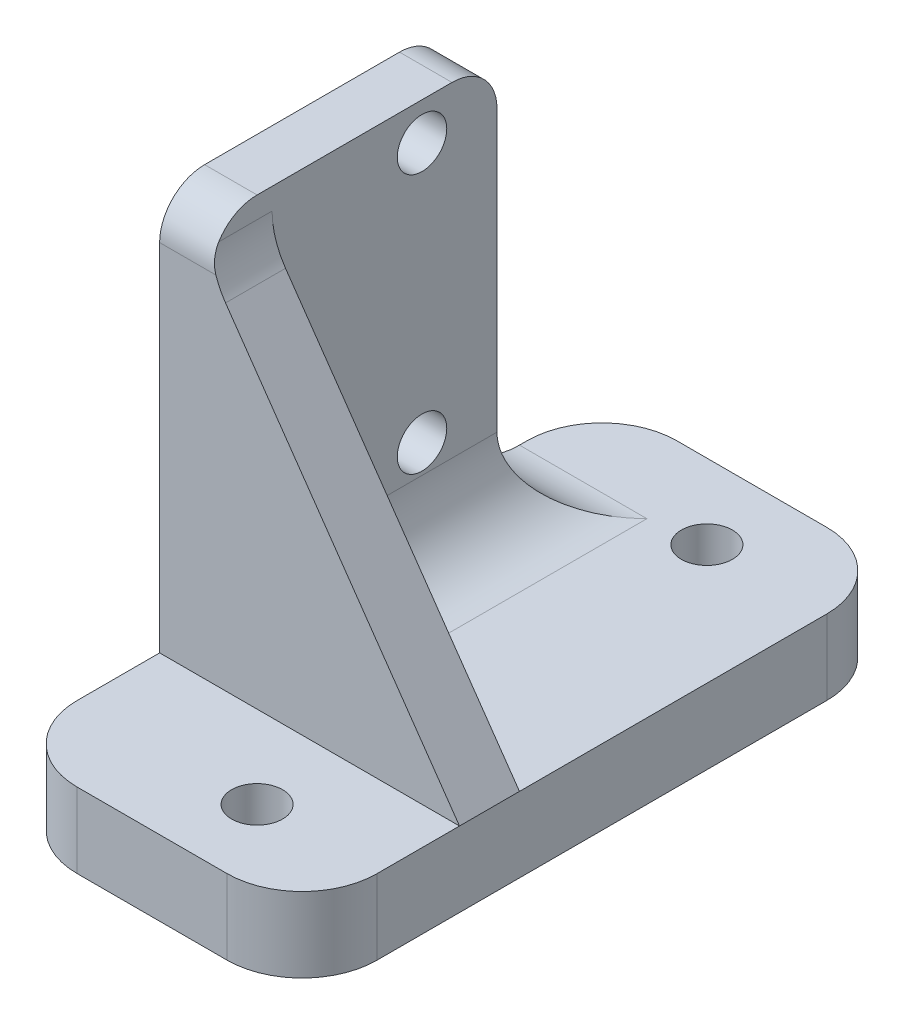
ISO-10303-21;
HEADER;
FILE_DESCRIPTION(('STEP AP214'),'2;1');
FILE_NAME('part.step','',(''),(''),'','','');
FILE_SCHEMA(('AUTOMOTIVE_DESIGN { 1 0 10303 214 1 1 1 1 }'));
ENDSEC;
DATA;
#1=APPLICATION_CONTEXT('core data for automotive mechanical design processes');
#2=APPLICATION_PROTOCOL_DEFINITION('international standard','automotive_design',2000,#1);
#3=PRODUCT_CONTEXT('',#1,'mechanical');
#4=PRODUCT('Part','Part','',(#3));
#5=PRODUCT_RELATED_PRODUCT_CATEGORY('part','',(#4));
#6=PRODUCT_DEFINITION_FORMATION('','',#4);
#7=PRODUCT_DEFINITION_CONTEXT('part definition',#1,'design');
#8=PRODUCT_DEFINITION('design','',#6,#7);
#9=PRODUCT_DEFINITION_SHAPE('','',#8);
#10=(LENGTH_UNIT() NAMED_UNIT(*) SI_UNIT(.MILLI.,.METRE.));
#11=(NAMED_UNIT(*) PLANE_ANGLE_UNIT() SI_UNIT($,.RADIAN.));
#12=(NAMED_UNIT(*) SI_UNIT($,.STERADIAN.) SOLID_ANGLE_UNIT());
#13=UNCERTAINTY_MEASURE_WITH_UNIT(LENGTH_MEASURE(1.E-05),#10,'distance_accuracy_value','');
#14=(GEOMETRIC_REPRESENTATION_CONTEXT(3) GLOBAL_UNCERTAINTY_ASSIGNED_CONTEXT((#13)) GLOBAL_UNIT_ASSIGNED_CONTEXT((#10,
#11,#12)) REPRESENTATION_CONTEXT('',''));
#15=CARTESIAN_POINT('',(0.,0.,0.));
#16=DIRECTION('',(0.,0.,1.));
#17=DIRECTION('',(1.,0.,0.));
#18=AXIS2_PLACEMENT_3D('',#15,#16,#17);
#19=CARTESIAN_POINT('',(0.,5.,0.));
#20=DIRECTION('',(0.,-1.,0.));
#21=DIRECTION('',(0.,0.,-1.));
#22=AXIS2_PLACEMENT_3D('',#19,#20,#21);
#23=PLANE('',#22);
#24=CARTESIAN_POINT('',(12.,5.,-35.));
#25=DIRECTION('',(0.,1.,0.));
#26=DIRECTION('',(0.,0.,1.));
#27=AXIS2_PLACEMENT_3D('',#24,#25,#26);
#28=CIRCLE('',#27,1.7);
#29=CARTESIAN_POINT('',(12.,5.,-33.3));
#30=VERTEX_POINT('',#29);
#31=EDGE_CURVE('E418',#30,#30,#28,.T.);
#32=ORIENTED_EDGE('',*,*,#31,.F.);
#33=EDGE_LOOP('',(#32));
#34=FACE_BOUND('',#33,.T.);
#35=DIRECTION('',(-1.,0.,0.));
#36=VECTOR('',#35,1.);
#37=CARTESIAN_POINT('',(0.,5.,-34.5));
#38=LINE('',#37,#36);
#39=CARTESIAN_POINT('',(0.,5.,-34.5));
#40=VERTEX_POINT('',#39);
#41=CARTESIAN_POINT('',(8.5,5.,-34.5));
#42=VERTEX_POINT('',#41);
#43=EDGE_CURVE('E287',#40,#42,#38,.F.);
#44=ORIENTED_EDGE('',*,*,#43,.T.);
#45=DIRECTION('',(0.,0.,1.));
#46=VECTOR('',#45,1.);
#47=CARTESIAN_POINT('',(8.5,5.,0.));
#48=LINE('',#47,#46);
#49=CARTESIAN_POINT('',(8.5,5.,-14.5));
#50=VERTEX_POINT('',#49);
#51=EDGE_CURVE('E289',#42,#50,#48,.T.);
#52=ORIENTED_EDGE('',*,*,#51,.T.);
#53=DIRECTION('',(-1.,0.,0.));
#54=VECTOR('',#53,1.);
#55=CARTESIAN_POINT('',(0.,5.,-14.5));
#56=LINE('',#55,#54);
#57=CARTESIAN_POINT('',(20.,5.,-14.5));
#58=VERTEX_POINT('',#57);
#59=EDGE_CURVE('E199',#58,#50,#56,.T.);
#60=ORIENTED_EDGE('',*,*,#59,.F.);
#61=DIRECTION('',(0.,0.,-1.));
#62=VECTOR('',#61,1.);
#63=CARTESIAN_POINT('',(20.,5.,0.));
#64=LINE('',#63,#62);
#65=CARTESIAN_POINT('',(20.,5.,-35.));
#66=VERTEX_POINT('',#65);
#67=EDGE_CURVE('E198',#58,#66,#64,.T.);
#68=ORIENTED_EDGE('',*,*,#67,.T.);
#69=CARTESIAN_POINT('',(15.,5.,-35.));
#70=DIRECTION('',(0.,-1.,0.));
#71=DIRECTION('',(0.,0.,-1.));
#72=AXIS2_PLACEMENT_3D('',#69,#70,#71);
#73=CIRCLE('',#72,5.);
#74=CARTESIAN_POINT('',(15.,5.,-40.));
#75=VERTEX_POINT('',#74);
#76=EDGE_CURVE('E254',#66,#75,#73,.F.);
#77=ORIENTED_EDGE('',*,*,#76,.T.);
#78=DIRECTION('',(-1.,0.,0.));
#79=VECTOR('',#78,1.);
#80=CARTESIAN_POINT('',(0.,5.,-40.));
#81=LINE('',#80,#79);
#82=CARTESIAN_POINT('',(5.,5.,-40.));
#83=VERTEX_POINT('',#82);
#84=EDGE_CURVE('E205',#75,#83,#81,.T.);
#85=ORIENTED_EDGE('',*,*,#84,.T.);
#86=CARTESIAN_POINT('',(5.,5.,-35.));
#87=DIRECTION('',(0.,-1.,0.));
#88=DIRECTION('',(0.,0.,-1.));
#89=AXIS2_PLACEMENT_3D('',#86,#87,#88);
#90=CIRCLE('',#89,5.);
#91=CARTESIAN_POINT('',(0.,5.,-35.));
#92=VERTEX_POINT('',#91);
#93=EDGE_CURVE('E252',#83,#92,#90,.F.);
#94=ORIENTED_EDGE('',*,*,#93,.T.);
#95=DIRECTION('',(0.,0.,1.));
#96=VECTOR('',#95,1.);
#97=CARTESIAN_POINT('',(0.,5.,0.));
#98=LINE('',#97,#96);
#99=EDGE_CURVE('E393',#92,#40,#98,.T.);
#100=ORIENTED_EDGE('',*,*,#99,.T.);
#101=EDGE_LOOP('',(#44,#52,#60,#68,#77,#85,#94,#100));
#102=FACE_BOUND('',#101,.T.);
#103=ADVANCED_FACE('F34',(#34,#102),#23,.F.);
#104=CARTESIAN_POINT('',(12.,5.,-4.99999999999999));
#105=DIRECTION('',(0.,1.,0.));
#106=DIRECTION('',(0.,0.,-1.));
#107=AXIS2_PLACEMENT_3D('',#104,#105,#106);
#108=CIRCLE('',#107,1.7);
#109=CARTESIAN_POINT('',(12.,5.,-6.69999999999999));
#110=VERTEX_POINT('',#109);
#111=EDGE_CURVE('E412',#110,#110,#108,.T.);
#112=ORIENTED_EDGE('',*,*,#111,.F.);
#113=EDGE_LOOP('',(#112));
#114=FACE_BOUND('',#113,.T.);
#115=CARTESIAN_POINT('',(20.,5.,-5.));
#116=VERTEX_POINT('',#115);
#117=CARTESIAN_POINT('',(20.,5.,-10.5));
#118=VERTEX_POINT('',#117);
#119=EDGE_CURVE('E195',#116,#118,#64,.T.);
#120=ORIENTED_EDGE('',*,*,#119,.T.);
#121=DIRECTION('',(-1.,0.,0.));
#122=VECTOR('',#121,1.);
#123=CARTESIAN_POINT('',(3.5,5.,-10.5));
#124=LINE('',#123,#122);
#125=CARTESIAN_POINT('',(0.,5.,-10.5));
#126=VERTEX_POINT('',#125);
#127=EDGE_CURVE('E179',#118,#126,#124,.T.);
#128=ORIENTED_EDGE('',*,*,#127,.T.);
#129=CARTESIAN_POINT('',(0.,5.,-5.));
#130=VERTEX_POINT('',#129);
#131=EDGE_CURVE('E223',#126,#130,#98,.T.);
#132=ORIENTED_EDGE('',*,*,#131,.T.);
#133=CARTESIAN_POINT('',(5.,5.,-5.));
#134=DIRECTION('',(0.,-1.,0.));
#135=DIRECTION('',(0.,0.,-1.));
#136=AXIS2_PLACEMENT_3D('',#133,#134,#135);
#137=CIRCLE('',#136,5.);
#138=CARTESIAN_POINT('',(5.,5.,0.));
#139=VERTEX_POINT('',#138);
#140=EDGE_CURVE('E256',#130,#139,#137,.F.);
#141=ORIENTED_EDGE('',*,*,#140,.T.);
#142=DIRECTION('',(1.,0.,0.));
#143=VECTOR('',#142,1.);
#144=CARTESIAN_POINT('',(0.,5.,0.));
#145=LINE('',#144,#143);
#146=CARTESIAN_POINT('',(15.,5.,0.));
#147=VERTEX_POINT('',#146);
#148=EDGE_CURVE('E210',#139,#147,#145,.T.);
#149=ORIENTED_EDGE('',*,*,#148,.T.);
#150=CARTESIAN_POINT('',(15.,5.,-5.));
#151=DIRECTION('',(0.,-1.,0.));
#152=DIRECTION('',(0.,0.,-1.));
#153=AXIS2_PLACEMENT_3D('',#150,#151,#152);
#154=CIRCLE('',#153,5.);
#155=EDGE_CURVE('E204',#147,#116,#154,.F.);
#156=ORIENTED_EDGE('',*,*,#155,.T.);
#157=EDGE_LOOP('',(#120,#128,#132,#141,#149,#156));
#158=FACE_BOUND('',#157,.T.);
#159=ADVANCED_FACE('F201',(#114,#158),#23,.F.);
#160=CARTESIAN_POINT('',(0.,5.,0.));
#161=DIRECTION('',(1.,0.,0.));
#162=DIRECTION('',(0.,0.,-1.));
#163=AXIS2_PLACEMENT_3D('',#160,#161,#162);
#164=PLANE('',#163);
#165=ORIENTED_EDGE('',*,*,#131,.F.);
#166=DIRECTION('',(0.,1.,0.));
#167=VECTOR('',#166,1.);
#168=CARTESIAN_POINT('',(0.,5.,-10.5));
#169=LINE('',#168,#167);
#170=CARTESIAN_POINT('',(0.,28.7,-10.5));
#171=VERTEX_POINT('',#170);
#172=EDGE_CURVE('E182',#126,#171,#169,.T.);
#173=ORIENTED_EDGE('',*,*,#172,.T.);
#174=CARTESIAN_POINT('',(0.,28.7,-13.5));
#175=DIRECTION('',(1.,0.,0.));
#176=DIRECTION('',(0.,0.,-1.));
#177=AXIS2_PLACEMENT_3D('',#174,#175,#176);
#178=CIRCLE('',#177,3.);
#179=CARTESIAN_POINT('',(0.,31.7,-13.5));
#180=VERTEX_POINT('',#179);
#181=EDGE_CURVE('E272',#171,#180,#178,.F.);
#182=ORIENTED_EDGE('',*,*,#181,.T.);
#183=DIRECTION('',(0.,0.,-1.));
#184=VECTOR('',#183,1.);
#185=CARTESIAN_POINT('',(0.,31.7,-29.5));
#186=LINE('',#185,#184);
#187=CARTESIAN_POINT('',(0.,31.7,-26.5));
#188=VERTEX_POINT('',#187);
#189=EDGE_CURVE('E398',#180,#188,#186,.T.);
#190=ORIENTED_EDGE('',*,*,#189,.T.);
#191=CARTESIAN_POINT('',(0.,28.7,-26.5));
#192=DIRECTION('',(1.,0.,0.));
#193=DIRECTION('',(0.,0.,-1.));
#194=AXIS2_PLACEMENT_3D('',#191,#192,#193);
#195=CIRCLE('',#194,3.);
#196=CARTESIAN_POINT('',(0.,28.7,-29.5));
#197=VERTEX_POINT('',#196);
#198=EDGE_CURVE('E274',#188,#197,#195,.F.);
#199=ORIENTED_EDGE('',*,*,#198,.T.);
#200=DIRECTION('',(0.,-1.,0.));
#201=VECTOR('',#200,1.);
#202=CARTESIAN_POINT('',(0.,5.,-29.5));
#203=LINE('',#202,#201);
#204=CARTESIAN_POINT('',(0.,10.,-29.5));
#205=VERTEX_POINT('',#204);
#206=EDGE_CURVE('E231',#197,#205,#203,.T.);
#207=ORIENTED_EDGE('',*,*,#206,.T.);
#208=CARTESIAN_POINT('',(0.,10.,-34.5));
#209=DIRECTION('',(1.,0.,0.));
#210=DIRECTION('',(0.,0.,-1.));
#211=AXIS2_PLACEMENT_3D('',#208,#209,#210);
#212=CIRCLE('',#211,5.);
#213=EDGE_CURVE('E11',#205,#40,#212,.T.);
#214=ORIENTED_EDGE('',*,*,#213,.T.);
#215=ORIENTED_EDGE('',*,*,#99,.F.);
#216=DIRECTION('',(0.,-1.,0.));
#217=VECTOR('',#216,1.);
#218=CARTESIAN_POINT('',(0.,5.,-35.));
#219=LINE('',#218,#217);
#220=CARTESIAN_POINT('',(0.,0.,-35.));
#221=VERTEX_POINT('',#220);
#222=EDGE_CURVE('E246',#92,#221,#219,.T.);
#223=ORIENTED_EDGE('',*,*,#222,.T.);
#224=DIRECTION('',(0.,0.,1.));
#225=VECTOR('',#224,1.);
#226=CARTESIAN_POINT('',(0.,0.,0.));
#227=LINE('',#226,#225);
#228=CARTESIAN_POINT('',(0.,0.,-5.));
#229=VERTEX_POINT('',#228);
#230=EDGE_CURVE('E187',#221,#229,#227,.T.);
#231=ORIENTED_EDGE('',*,*,#230,.T.);
#232=DIRECTION('',(0.,-1.,0.));
#233=VECTOR('',#232,1.);
#234=CARTESIAN_POINT('',(0.,5.,-5.));
#235=LINE('',#234,#233);
#236=EDGE_CURVE('E249',#229,#130,#235,.F.);
#237=ORIENTED_EDGE('',*,*,#236,.T.);
#238=EDGE_LOOP('',(#165,#173,#182,#190,#199,#207,#214,#215,#223,#231,#237));
#239=FACE_BOUND('',#238,.T.);
#240=CARTESIAN_POINT('',(0.,11.9,-24.5));
#241=DIRECTION('',(-1.,0.,0.));
#242=DIRECTION('',(0.,0.,-1.));
#243=AXIS2_PLACEMENT_3D('',#240,#241,#242);
#244=CIRCLE('',#243,1.65);
#245=CARTESIAN_POINT('',(0.,11.9,-26.15));
#246=VERTEX_POINT('',#245);
#247=EDGE_CURVE('E406',#246,#246,#244,.T.);
#248=ORIENTED_EDGE('',*,*,#247,.F.);
#249=EDGE_LOOP('',(#248));
#250=FACE_BOUND('',#249,.T.);
#251=CARTESIAN_POINT('',(0.,29.2,-24.5));
#252=DIRECTION('',(-1.,0.,0.));
#253=DIRECTION('',(0.,0.,1.));
#254=AXIS2_PLACEMENT_3D('',#251,#252,#253);
#255=CIRCLE('',#254,1.65);
#256=CARTESIAN_POINT('',(0.,29.2,-22.85));
#257=VERTEX_POINT('',#256);
#258=EDGE_CURVE('E228',#257,#257,#255,.T.);
#259=ORIENTED_EDGE('',*,*,#258,.F.);
#260=EDGE_LOOP('',(#259));
#261=FACE_BOUND('',#260,.T.);
#262=ADVANCED_FACE('F335',(#239,#250,#261),#164,.F.);
#263=CARTESIAN_POINT('',(0.,5.,0.));
#264=DIRECTION('',(0.,0.,-1.));
#265=DIRECTION('',(-1.,0.,0.));
#266=AXIS2_PLACEMENT_3D('',#263,#264,#265);
#267=PLANE('',#266);
#268=ORIENTED_EDGE('',*,*,#148,.F.);
#269=DIRECTION('',(0.,-1.,0.));
#270=VECTOR('',#269,1.);
#271=CARTESIAN_POINT('',(5.,5.,0.));
#272=LINE('',#271,#270);
#273=CARTESIAN_POINT('',(5.,0.,0.));
#274=VERTEX_POINT('',#273);
#275=EDGE_CURVE('E233',#139,#274,#272,.T.);
#276=ORIENTED_EDGE('',*,*,#275,.T.);
#277=DIRECTION('',(1.,0.,0.));
#278=VECTOR('',#277,1.);
#279=CARTESIAN_POINT('',(0.,0.,0.));
#280=LINE('',#279,#278);
#281=CARTESIAN_POINT('',(15.,0.,0.));
#282=VERTEX_POINT('',#281);
#283=EDGE_CURVE('E215',#274,#282,#280,.T.);
#284=ORIENTED_EDGE('',*,*,#283,.T.);
#285=DIRECTION('',(0.,-1.,0.));
#286=VECTOR('',#285,1.);
#287=CARTESIAN_POINT('',(15.,5.,0.));
#288=LINE('',#287,#286);
#289=EDGE_CURVE('E208',#282,#147,#288,.F.);
#290=ORIENTED_EDGE('',*,*,#289,.T.);
#291=EDGE_LOOP('',(#268,#276,#284,#290));
#292=FACE_BOUND('',#291,.T.);
#293=ADVANCED_FACE('F353',(#292),#267,.F.);
#294=CARTESIAN_POINT('',(20.,5.,0.));
#295=DIRECTION('',(-1.,0.,0.));
#296=DIRECTION('',(0.,0.,1.));
#297=AXIS2_PLACEMENT_3D('',#294,#295,#296);
#298=PLANE('',#297);
#299=DIRECTION('',(0.,0.,-1.));
#300=VECTOR('',#299,1.);
#301=CARTESIAN_POINT('',(20.,0.,0.));
#302=LINE('',#301,#300);
#303=CARTESIAN_POINT('',(20.,0.,-5.));
#304=VERTEX_POINT('',#303);
#305=CARTESIAN_POINT('',(20.,0.,-35.));
#306=VERTEX_POINT('',#305);
#307=EDGE_CURVE('E218',#304,#306,#302,.T.);
#308=ORIENTED_EDGE('',*,*,#307,.T.);
#309=DIRECTION('',(0.,-1.,0.));
#310=VECTOR('',#309,1.);
#311=CARTESIAN_POINT('',(20.,5.,-35.));
#312=LINE('',#311,#310);
#313=EDGE_CURVE('E265',#306,#66,#312,.F.);
#314=ORIENTED_EDGE('',*,*,#313,.T.);
#315=ORIENTED_EDGE('',*,*,#67,.F.);
#316=DIRECTION('',(0.,0.,1.));
#317=VECTOR('',#316,1.);
#318=CARTESIAN_POINT('',(20.,5.,0.));
#319=LINE('',#318,#317);
#320=EDGE_CURVE('E171',#118,#58,#319,.F.);
#321=ORIENTED_EDGE('',*,*,#320,.F.);
#322=ORIENTED_EDGE('',*,*,#119,.F.);
#323=DIRECTION('',(0.,-1.,0.));
#324=VECTOR('',#323,1.);
#325=CARTESIAN_POINT('',(20.,5.,-5.));
#326=LINE('',#325,#324);
#327=EDGE_CURVE('E263',#116,#304,#326,.T.);
#328=ORIENTED_EDGE('',*,*,#327,.T.);
#329=EDGE_LOOP('',(#308,#314,#315,#321,#322,#328));
#330=FACE_BOUND('',#329,.T.);
#331=ADVANCED_FACE('F193',(#330),#298,.F.);
#332=CARTESIAN_POINT('',(0.,5.,-40.));
#333=DIRECTION('',(0.,0.,1.));
#334=DIRECTION('',(1.,0.,0.));
#335=AXIS2_PLACEMENT_3D('',#332,#333,#334);
#336=PLANE('',#335);
#337=ORIENTED_EDGE('',*,*,#84,.F.);
#338=DIRECTION('',(0.,-1.,0.));
#339=VECTOR('',#338,1.);
#340=CARTESIAN_POINT('',(15.,5.,-40.));
#341=LINE('',#340,#339);
#342=CARTESIAN_POINT('',(15.,0.,-40.));
#343=VERTEX_POINT('',#342);
#344=EDGE_CURVE('E260',#75,#343,#341,.T.);
#345=ORIENTED_EDGE('',*,*,#344,.T.);
#346=DIRECTION('',(-1.,0.,0.));
#347=VECTOR('',#346,1.);
#348=CARTESIAN_POINT('',(0.,0.,-40.));
#349=LINE('',#348,#347);
#350=CARTESIAN_POINT('',(5.,0.,-40.));
#351=VERTEX_POINT('',#350);
#352=EDGE_CURVE('E220',#343,#351,#349,.T.);
#353=ORIENTED_EDGE('',*,*,#352,.T.);
#354=DIRECTION('',(0.,-1.,0.));
#355=VECTOR('',#354,1.);
#356=CARTESIAN_POINT('',(5.,5.,-40.));
#357=LINE('',#356,#355);
#358=EDGE_CURVE('E258',#351,#83,#357,.F.);
#359=ORIENTED_EDGE('',*,*,#358,.T.);
#360=EDGE_LOOP('',(#337,#345,#353,#359));
#361=FACE_BOUND('',#360,.T.);
#362=ADVANCED_FACE('F346',(#361),#336,.F.);
#363=CARTESIAN_POINT('',(0.,0.,0.));
#364=DIRECTION('',(0.,-1.,0.));
#365=DIRECTION('',(0.,0.,-1.));
#366=AXIS2_PLACEMENT_3D('',#363,#364,#365);
#367=PLANE('',#366);
#368=CARTESIAN_POINT('',(5.,0.,-5.));
#369=DIRECTION('',(0.,-1.,0.));
#370=DIRECTION('',(0.,0.,-1.));
#371=AXIS2_PLACEMENT_3D('',#368,#369,#370);
#372=CIRCLE('',#371,5.);
#373=EDGE_CURVE('E243',#274,#229,#372,.T.);
#374=ORIENTED_EDGE('',*,*,#373,.T.);
#375=ORIENTED_EDGE('',*,*,#230,.F.);
#376=CARTESIAN_POINT('',(5.,0.,-35.));
#377=DIRECTION('',(0.,-1.,0.));
#378=DIRECTION('',(0.,0.,-1.));
#379=AXIS2_PLACEMENT_3D('',#376,#377,#378);
#380=CIRCLE('',#379,5.);
#381=EDGE_CURVE('E238',#221,#351,#380,.T.);
#382=ORIENTED_EDGE('',*,*,#381,.T.);
#383=ORIENTED_EDGE('',*,*,#352,.F.);
#384=CARTESIAN_POINT('',(15.,0.,-35.));
#385=DIRECTION('',(0.,-1.,0.));
#386=DIRECTION('',(0.,0.,-1.));
#387=AXIS2_PLACEMENT_3D('',#384,#385,#386);
#388=CIRCLE('',#387,5.);
#389=EDGE_CURVE('E240',#343,#306,#388,.T.);
#390=ORIENTED_EDGE('',*,*,#389,.T.);
#391=ORIENTED_EDGE('',*,*,#307,.F.);
#392=CARTESIAN_POINT('',(15.,0.,-5.));
#393=DIRECTION('',(0.,-1.,0.));
#394=DIRECTION('',(0.,0.,-1.));
#395=AXIS2_PLACEMENT_3D('',#392,#393,#394);
#396=CIRCLE('',#395,5.);
#397=EDGE_CURVE('E236',#304,#282,#396,.T.);
#398=ORIENTED_EDGE('',*,*,#397,.T.);
#399=ORIENTED_EDGE('',*,*,#283,.F.);
#400=EDGE_LOOP('',(#374,#375,#382,#383,#390,#391,#398,#399));
#401=FACE_BOUND('',#400,.T.);
#402=CARTESIAN_POINT('',(12.,0.,-4.99999999999999));
#403=DIRECTION('',(0.,1.,0.));
#404=DIRECTION('',(0.,0.,-1.));
#405=AXIS2_PLACEMENT_3D('',#402,#403,#404);
#406=CIRCLE('',#405,1.7);
#407=CARTESIAN_POINT('',(12.,0.,-6.69999999999999));
#408=VERTEX_POINT('',#407);
#409=EDGE_CURVE('E415',#408,#408,#406,.T.);
#410=ORIENTED_EDGE('',*,*,#409,.T.);
#411=EDGE_LOOP('',(#410));
#412=FACE_BOUND('',#411,.T.);
#413=CARTESIAN_POINT('',(12.,0.,-35.));
#414=DIRECTION('',(0.,1.,0.));
#415=DIRECTION('',(0.,0.,1.));
#416=AXIS2_PLACEMENT_3D('',#413,#414,#415);
#417=CIRCLE('',#416,1.7);
#418=CARTESIAN_POINT('',(12.,0.,-33.3));
#419=VERTEX_POINT('',#418);
#420=EDGE_CURVE('E409',#419,#419,#417,.T.);
#421=ORIENTED_EDGE('',*,*,#420,.T.);
#422=EDGE_LOOP('',(#421));
#423=FACE_BOUND('',#422,.T.);
#424=ADVANCED_FACE('F343',(#401,#412,#423),#367,.T.);
#425=CARTESIAN_POINT('',(3.5,5.,-29.5));
#426=DIRECTION('',(0.,0.,-1.));
#427=DIRECTION('',(-1.,0.,0.));
#428=AXIS2_PLACEMENT_3D('',#425,#426,#427);
#429=PLANE('',#428);
#430=DIRECTION('',(0.,-1.,0.));
#431=VECTOR('',#430,1.);
#432=CARTESIAN_POINT('',(3.5,5.,-29.5));
#433=LINE('',#432,#431);
#434=CARTESIAN_POINT('',(3.5,28.7,-29.5));
#435=VERTEX_POINT('',#434);
#436=CARTESIAN_POINT('',(3.5,10.,-29.5));
#437=VERTEX_POINT('',#436);
#438=EDGE_CURVE('E400',#435,#437,#433,.T.);
#439=ORIENTED_EDGE('',*,*,#438,.T.);
#440=DIRECTION('',(-1.,0.,0.));
#441=VECTOR('',#440,1.);
#442=CARTESIAN_POINT('',(3.5,10.,-29.5));
#443=LINE('',#442,#441);
#444=EDGE_CURVE('E59',#437,#205,#443,.T.);
#445=ORIENTED_EDGE('',*,*,#444,.T.);
#446=ORIENTED_EDGE('',*,*,#206,.F.);
#447=DIRECTION('',(-1.,0.,0.));
#448=VECTOR('',#447,1.);
#449=CARTESIAN_POINT('',(3.5,28.7,-29.5));
#450=LINE('',#449,#448);
#451=EDGE_CURVE('E276',#197,#435,#450,.F.);
#452=ORIENTED_EDGE('',*,*,#451,.T.);
#453=EDGE_LOOP('',(#439,#445,#446,#452));
#454=FACE_BOUND('',#453,.T.);
#455=ADVANCED_FACE('F341',(#454),#429,.T.);
#456=CARTESIAN_POINT('',(3.5,31.7,-29.5));
#457=DIRECTION('',(0.,1.,0.));
#458=DIRECTION('',(0.,0.,1.));
#459=AXIS2_PLACEMENT_3D('',#456,#457,#458);
#460=PLANE('',#459);
#461=DIRECTION('',(-1.,0.,0.));
#462=VECTOR('',#461,1.);
#463=CARTESIAN_POINT('',(3.5,31.7,-13.5));
#464=LINE('',#463,#462);
#465=CARTESIAN_POINT('',(3.5,31.7,-13.5));
#466=VERTEX_POINT('',#465);
#467=EDGE_CURVE('E267',#180,#466,#464,.F.);
#468=ORIENTED_EDGE('',*,*,#467,.T.);
#469=DIRECTION('',(0.,0.,-1.));
#470=VECTOR('',#469,1.);
#471=CARTESIAN_POINT('',(3.5,31.7,-29.5));
#472=LINE('',#471,#470);
#473=CARTESIAN_POINT('',(3.5,31.7,-26.5));
#474=VERTEX_POINT('',#473);
#475=EDGE_CURVE('E188',#466,#474,#472,.T.);
#476=ORIENTED_EDGE('',*,*,#475,.T.);
#477=DIRECTION('',(-1.,0.,0.));
#478=VECTOR('',#477,1.);
#479=CARTESIAN_POINT('',(3.5,31.7,-26.5));
#480=LINE('',#479,#478);
#481=EDGE_CURVE('E269',#474,#188,#480,.T.);
#482=ORIENTED_EDGE('',*,*,#481,.T.);
#483=ORIENTED_EDGE('',*,*,#189,.F.);
#484=EDGE_LOOP('',(#468,#476,#482,#483));
#485=FACE_BOUND('',#484,.T.);
#486=ADVANCED_FACE('F448',(#485),#460,.T.);
#487=CARTESIAN_POINT('',(3.5,5.,-10.5));
#488=DIRECTION('',(0.,0.,1.));
#489=DIRECTION('',(0.,-1.,0.));
#490=AXIS2_PLACEMENT_3D('',#487,#488,#489);
#491=PLANE('',#490);
#492=ORIENTED_EDGE('',*,*,#127,.F.);
#493=DIRECTION('',(0.571368826083305,-0.820693404737838,0.));
#494=VECTOR('',#493,1.);
#495=CARTESIAN_POINT('',(3.5,28.7,-10.5));
#496=LINE('',#495,#494);
#497=CARTESIAN_POINT('',(4.39653297631081,27.4122526340263,-10.5));
#498=VERTEX_POINT('',#497);
#499=EDGE_CURVE('E166',#498,#118,#496,.T.);
#500=ORIENTED_EDGE('',*,*,#499,.F.);
#501=CARTESIAN_POINT('',(8.5,30.2690967644428,-10.5));
#502=DIRECTION('',(0.,0.,1.));
#503=DIRECTION('',(0.,-1.,0.));
#504=AXIS2_PLACEMENT_3D('',#501,#502,#503);
#505=CIRCLE('',#504,5.);
#506=CARTESIAN_POINT('',(3.75258645746812,28.7,-10.5));
#507=VERTEX_POINT('',#506);
#508=EDGE_CURVE('E301',#498,#507,#505,.F.);
#509=ORIENTED_EDGE('',*,*,#508,.T.);
#510=DIRECTION('',(-1.,0.,0.));
#511=VECTOR('',#510,1.);
#512=CARTESIAN_POINT('',(3.5,28.7,-10.5));
#513=LINE('',#512,#511);
#514=EDGE_CURVE('E51',#507,#171,#513,.T.);
#515=ORIENTED_EDGE('',*,*,#514,.T.);
#516=ORIENTED_EDGE('',*,*,#172,.F.);
#517=EDGE_LOOP('',(#492,#500,#509,#515,#516));
#518=FACE_BOUND('',#517,.T.);
#519=ADVANCED_FACE('F180',(#518),#491,.T.);
#520=CARTESIAN_POINT('',(3.5,0.,0.));
#521=DIRECTION('',(1.,0.,0.));
#522=DIRECTION('',(0.,0.,-1.));
#523=AXIS2_PLACEMENT_3D('',#520,#521,#522);
#524=PLANE('',#523);
#525=DIRECTION('',(0.,-1.,0.));
#526=VECTOR('',#525,1.);
#527=CARTESIAN_POINT('',(3.5,0.,-14.5));
#528=LINE('',#527,#526);
#529=CARTESIAN_POINT('',(3.5,30.2690967644428,-14.5));
#530=VERTEX_POINT('',#529);
#531=CARTESIAN_POINT('',(3.5,10.,-14.5));
#532=VERTEX_POINT('',#531);
#533=EDGE_CURVE('E284',#530,#532,#528,.T.);
#534=ORIENTED_EDGE('',*,*,#533,.T.);
#535=DIRECTION('',(0.,0.,1.));
#536=VECTOR('',#535,1.);
#537=CARTESIAN_POINT('',(3.5,10.,0.));
#538=LINE('',#537,#536);
#539=EDGE_CURVE('E297',#532,#437,#538,.F.);
#540=ORIENTED_EDGE('',*,*,#539,.T.);
#541=ORIENTED_EDGE('',*,*,#438,.F.);
#542=CARTESIAN_POINT('',(3.5,28.7,-26.5));
#543=DIRECTION('',(1.,0.,0.));
#544=DIRECTION('',(0.,0.,-1.));
#545=AXIS2_PLACEMENT_3D('',#542,#543,#544);
#546=CIRCLE('',#545,3.);
#547=EDGE_CURVE('E281',#435,#474,#546,.T.);
#548=ORIENTED_EDGE('',*,*,#547,.T.);
#549=ORIENTED_EDGE('',*,*,#475,.F.);
#550=CARTESIAN_POINT('',(3.5,28.7,-13.5));
#551=DIRECTION('',(1.,0.,0.));
#552=DIRECTION('',(0.,0.,-1.));
#553=AXIS2_PLACEMENT_3D('',#550,#551,#552);
#554=CIRCLE('',#553,3.);
#555=CARTESIAN_POINT('',(3.5,30.2690967644428,-10.9430613335836));
#556=VERTEX_POINT('',#555);
#557=EDGE_CURVE('E278',#466,#556,#554,.T.);
#558=ORIENTED_EDGE('',*,*,#557,.T.);
#559=DIRECTION('',(0.,0.,-1.));
#560=VECTOR('',#559,1.);
#561=CARTESIAN_POINT('',(3.5,30.2690967644428,-14.5));
#562=LINE('',#561,#560);
#563=EDGE_CURVE('E294',#556,#530,#562,.T.);
#564=ORIENTED_EDGE('',*,*,#563,.T.);
#565=EDGE_LOOP('',(#534,#540,#541,#548,#549,#558,#564));
#566=FACE_BOUND('',#565,.T.);
#567=CARTESIAN_POINT('',(3.5,29.2,-24.5));
#568=DIRECTION('',(1.,0.,0.));
#569=DIRECTION('',(0.,0.,-1.));
#570=AXIS2_PLACEMENT_3D('',#567,#568,#569);
#571=CIRCLE('',#570,1.65);
#572=CARTESIAN_POINT('',(3.5,29.2,-26.15));
#573=VERTEX_POINT('',#572);
#574=EDGE_CURVE('E227',#573,#573,#571,.T.);
#575=ORIENTED_EDGE('',*,*,#574,.F.);
#576=EDGE_LOOP('',(#575));
#577=FACE_BOUND('',#576,.T.);
#578=CARTESIAN_POINT('',(3.5,11.9,-24.5));
#579=DIRECTION('',(1.,0.,0.));
#580=DIRECTION('',(0.,0.,-1.));
#581=AXIS2_PLACEMENT_3D('',#578,#579,#580);
#582=CIRCLE('',#581,1.65);
#583=CARTESIAN_POINT('',(3.5,11.9,-26.15));
#584=VERTEX_POINT('',#583);
#585=EDGE_CURVE('E224',#584,#584,#582,.T.);
#586=ORIENTED_EDGE('',*,*,#585,.F.);
#587=EDGE_LOOP('',(#586));
#588=FACE_BOUND('',#587,.T.);
#589=ADVANCED_FACE('F431',(#566,#577,#588),#524,.T.);
#590=CARTESIAN_POINT('',(20.,11.9,-24.5));
#591=DIRECTION('',(-1.,0.,0.));
#592=DIRECTION('',(0.,0.,1.));
#593=AXIS2_PLACEMENT_3D('',#590,#591,#592);
#594=CYLINDRICAL_SURFACE('',#593,1.65);
#595=ORIENTED_EDGE('',*,*,#585,.T.);
#596=EDGE_LOOP('',(#595));
#597=FACE_BOUND('',#596,.T.);
#598=ORIENTED_EDGE('',*,*,#247,.T.);
#599=EDGE_LOOP('',(#598));
#600=FACE_BOUND('',#599,.T.);
#601=ADVANCED_FACE('F463',(#597,#600),#594,.F.);
#602=CARTESIAN_POINT('',(20.,29.2,-24.5));
#603=DIRECTION('',(-1.,0.,0.));
#604=DIRECTION('',(0.,0.,1.));
#605=AXIS2_PLACEMENT_3D('',#602,#603,#604);
#606=CYLINDRICAL_SURFACE('',#605,1.65);
#607=ORIENTED_EDGE('',*,*,#574,.T.);
#608=EDGE_LOOP('',(#607));
#609=FACE_BOUND('',#608,.T.);
#610=ORIENTED_EDGE('',*,*,#258,.T.);
#611=EDGE_LOOP('',(#610));
#612=FACE_BOUND('',#611,.T.);
#613=ADVANCED_FACE('F466',(#609,#612),#606,.F.);
#614=CARTESIAN_POINT('',(12.,0.,-4.99999999999999));
#615=DIRECTION('',(0.,1.,0.));
#616=DIRECTION('',(0.,0.,1.));
#617=AXIS2_PLACEMENT_3D('',#614,#615,#616);
#618=CYLINDRICAL_SURFACE('',#617,1.7);
#619=ORIENTED_EDGE('',*,*,#409,.F.);
#620=EDGE_LOOP('',(#619));
#621=FACE_BOUND('',#620,.T.);
#622=ORIENTED_EDGE('',*,*,#111,.T.);
#623=EDGE_LOOP('',(#622));
#624=FACE_BOUND('',#623,.T.);
#625=ADVANCED_FACE('F470',(#621,#624),#618,.F.);
#626=CARTESIAN_POINT('',(12.,0.,-35.));
#627=DIRECTION('',(0.,1.,0.));
#628=DIRECTION('',(0.,0.,1.));
#629=AXIS2_PLACEMENT_3D('',#626,#627,#628);
#630=CYLINDRICAL_SURFACE('',#629,1.7);
#631=ORIENTED_EDGE('',*,*,#420,.F.);
#632=EDGE_LOOP('',(#631));
#633=FACE_BOUND('',#632,.T.);
#634=ORIENTED_EDGE('',*,*,#31,.T.);
#635=EDGE_LOOP('',(#634));
#636=FACE_BOUND('',#635,.T.);
#637=ADVANCED_FACE('F364',(#633,#636),#630,.F.);
#638=CARTESIAN_POINT('',(5.,5.,-5.));
#639=DIRECTION('',(0.,-1.,0.));
#640=DIRECTION('',(0.,0.,-1.));
#641=AXIS2_PLACEMENT_3D('',#638,#639,#640);
#642=CYLINDRICAL_SURFACE('',#641,5.);
#643=ORIENTED_EDGE('',*,*,#140,.F.);
#644=ORIENTED_EDGE('',*,*,#236,.F.);
#645=ORIENTED_EDGE('',*,*,#373,.F.);
#646=ORIENTED_EDGE('',*,*,#275,.F.);
#647=EDGE_LOOP('',(#643,#644,#645,#646));
#648=FACE_BOUND('',#647,.T.);
#649=ADVANCED_FACE('F360',(#648),#642,.T.);
#650=CARTESIAN_POINT('',(15.,5.,-35.));
#651=DIRECTION('',(0.,-1.,0.));
#652=DIRECTION('',(0.,0.,-1.));
#653=AXIS2_PLACEMENT_3D('',#650,#651,#652);
#654=CYLINDRICAL_SURFACE('',#653,5.);
#655=ORIENTED_EDGE('',*,*,#76,.F.);
#656=ORIENTED_EDGE('',*,*,#313,.F.);
#657=ORIENTED_EDGE('',*,*,#389,.F.);
#658=ORIENTED_EDGE('',*,*,#344,.F.);
#659=EDGE_LOOP('',(#655,#656,#657,#658));
#660=FACE_BOUND('',#659,.T.);
#661=ADVANCED_FACE('F363',(#660),#654,.T.);
#662=CARTESIAN_POINT('',(5.,5.,-35.));
#663=DIRECTION('',(0.,-1.,0.));
#664=DIRECTION('',(0.,0.,-1.));
#665=AXIS2_PLACEMENT_3D('',#662,#663,#664);
#666=CYLINDRICAL_SURFACE('',#665,5.);
#667=ORIENTED_EDGE('',*,*,#93,.F.);
#668=ORIENTED_EDGE('',*,*,#358,.F.);
#669=ORIENTED_EDGE('',*,*,#381,.F.);
#670=ORIENTED_EDGE('',*,*,#222,.F.);
#671=EDGE_LOOP('',(#667,#668,#669,#670));
#672=FACE_BOUND('',#671,.T.);
#673=ADVANCED_FACE('F368',(#672),#666,.T.);
#674=CARTESIAN_POINT('',(15.,5.,-5.));
#675=DIRECTION('',(0.,-1.,0.));
#676=DIRECTION('',(0.,0.,-1.));
#677=AXIS2_PLACEMENT_3D('',#674,#675,#676);
#678=CYLINDRICAL_SURFACE('',#677,5.);
#679=ORIENTED_EDGE('',*,*,#155,.F.);
#680=ORIENTED_EDGE('',*,*,#289,.F.);
#681=ORIENTED_EDGE('',*,*,#397,.F.);
#682=ORIENTED_EDGE('',*,*,#327,.F.);
#683=EDGE_LOOP('',(#679,#680,#681,#682));
#684=FACE_BOUND('',#683,.T.);
#685=ADVANCED_FACE('F371',(#684),#678,.T.);
#686=CARTESIAN_POINT('',(3.5,28.7,-26.5));
#687=DIRECTION('',(-1.,0.,0.));
#688=DIRECTION('',(0.,0.,1.));
#689=AXIS2_PLACEMENT_3D('',#686,#687,#688);
#690=CYLINDRICAL_SURFACE('',#689,3.);
#691=ORIENTED_EDGE('',*,*,#547,.F.);
#692=ORIENTED_EDGE('',*,*,#451,.F.);
#693=ORIENTED_EDGE('',*,*,#198,.F.);
#694=ORIENTED_EDGE('',*,*,#481,.F.);
#695=EDGE_LOOP('',(#691,#692,#693,#694));
#696=FACE_BOUND('',#695,.T.);
#697=ADVANCED_FACE('F316',(#696),#690,.T.);
#698=CARTESIAN_POINT('',(3.5,28.7,-13.5));
#699=DIRECTION('',(-1.,0.,0.));
#700=DIRECTION('',(0.,0.,1.));
#701=AXIS2_PLACEMENT_3D('',#698,#699,#700);
#702=CYLINDRICAL_SURFACE('',#701,3.);
#703=ORIENTED_EDGE('',*,*,#557,.F.);
#704=ORIENTED_EDGE('',*,*,#467,.F.);
#705=ORIENTED_EDGE('',*,*,#181,.F.);
#706=ORIENTED_EDGE('',*,*,#514,.F.);
#707=CARTESIAN_POINT('',(3.75258645746812,28.7,-10.5));
#708=CARTESIAN_POINT('',(3.72872303693519,28.7721555335833,-10.4999877960661));
#709=CARTESIAN_POINT('',(3.70652797502885,28.8448736329314,-10.502603252527));
#710=CARTESIAN_POINT('',(3.66554977947805,28.9908926137303,-10.5132420225407));
#711=CARTESIAN_POINT('',(3.64676755458967,29.0641936449943,-10.521266773787));
#712=CARTESIAN_POINT('',(3.61314987736942,29.2088740325996,-10.5425933572909));
#713=CARTESIAN_POINT('',(3.59822380605767,29.2802533510168,-10.5557512168147));
#714=CARTESIAN_POINT('',(3.57167790421138,29.4224109325786,-10.5873668686959));
#715=CARTESIAN_POINT('',(3.5600572074154,29.4931893484796,-10.6058232698769));
#716=CARTESIAN_POINT('',(3.53272762880566,29.6849588872068,-10.663468651817));
#717=CARTESIAN_POINT('',(3.52022586594764,29.8048923163659,-10.7079575664665));
#718=CARTESIAN_POINT('',(3.50792171043862,29.981393834327,-10.7866375555909));
#719=CARTESIAN_POINT('',(3.50489925154576,30.0403234950136,-10.8152596474598));
#720=CARTESIAN_POINT('',(3.50093816235208,30.1562354264242,-10.8763264463001));
#721=CARTESIAN_POINT('',(3.49999936606504,30.2132178519105,-10.9087708485665));
#722=CARTESIAN_POINT('',(3.5,30.2690967644428,-10.9430613335836));
#723=B_SPLINE_CURVE_WITH_KNOTS('',3,(#707,#708,#709,#710,#711,#712,#713,#714,#715,#716,#717,
#718,#719,#720,#721,#722),.UNSPECIFIED.,.F.,.F.,(4,2,2,2,2,2,2,4),(0.,0.227946926754806,
0.45595446160905,0.677980007668105,0.89994731229327,1.28393048994863,1.48053497167093,
1.67712379116281),.UNSPECIFIED.);
#724=EDGE_CURVE('E303',#507,#556,#723,.T.);
#725=ORIENTED_EDGE('',*,*,#724,.T.);
#726=EDGE_LOOP('',(#703,#704,#705,#706,#725));
#727=FACE_BOUND('',#726,.T.);
#728=ADVANCED_FACE('F310',(#727),#702,.T.);
#729=CARTESIAN_POINT('',(10.,15.85,-14.5));
#730=DIRECTION('',(0.,0.,1.));
#731=DIRECTION('',(1.,0.,0.));
#732=AXIS2_PLACEMENT_3D('',#729,#730,#731);
#733=PLANE('',#732);
#734=ORIENTED_EDGE('',*,*,#59,.T.);
#735=CARTESIAN_POINT('',(8.5,10.,-14.5));
#736=DIRECTION('',(0.,0.,1.));
#737=DIRECTION('',(1.,0.,0.));
#738=AXIS2_PLACEMENT_3D('',#735,#736,#737);
#739=CIRCLE('',#738,5.);
#740=EDGE_CURVE('E292',#50,#532,#739,.F.);
#741=ORIENTED_EDGE('',*,*,#740,.T.);
#742=ORIENTED_EDGE('',*,*,#533,.F.);
#743=CARTESIAN_POINT('',(8.5,30.2690967644428,-14.5));
#744=DIRECTION('',(0.,0.,1.));
#745=DIRECTION('',(1.,0.,0.));
#746=AXIS2_PLACEMENT_3D('',#743,#744,#745);
#747=CIRCLE('',#746,5.);
#748=CARTESIAN_POINT('',(4.39653297631081,27.4122526340263,-14.5));
#749=VERTEX_POINT('',#748);
#750=EDGE_CURVE('E44',#530,#749,#747,.T.);
#751=ORIENTED_EDGE('',*,*,#750,.T.);
#752=DIRECTION('',(0.571368826083305,-0.820693404737838,0.));
#753=VECTOR('',#752,1.);
#754=CARTESIAN_POINT('',(3.5,28.7,-14.5));
#755=LINE('',#754,#753);
#756=EDGE_CURVE('E176',#749,#58,#755,.T.);
#757=ORIENTED_EDGE('',*,*,#756,.T.);
#758=EDGE_LOOP('',(#734,#741,#742,#751,#757));
#759=FACE_BOUND('',#758,.T.);
#760=ADVANCED_FACE('F315',(#759),#733,.F.);
#761=CARTESIAN_POINT('',(3.5,28.7,-10.5));
#762=DIRECTION('',(-0.820693404737838,-0.571368826083305,0.));
#763=DIRECTION('',(0.571368826083305,-0.820693404737838,0.));
#764=AXIS2_PLACEMENT_3D('',#761,#762,#763);
#765=PLANE('',#764);
#766=ORIENTED_EDGE('',*,*,#756,.F.);
#767=DIRECTION('',(0.,0.,1.));
#768=VECTOR('',#767,1.);
#769=CARTESIAN_POINT('',(4.39653297631081,27.4122526340263,-10.5));
#770=LINE('',#769,#768);
#771=EDGE_CURVE('E174',#749,#498,#770,.T.);
#772=ORIENTED_EDGE('',*,*,#771,.T.);
#773=ORIENTED_EDGE('',*,*,#499,.T.);
#774=ORIENTED_EDGE('',*,*,#320,.T.);
#775=EDGE_LOOP('',(#766,#772,#773,#774));
#776=FACE_BOUND('',#775,.T.);
#777=ADVANCED_FACE('F169',(#776),#765,.F.);
#778=CARTESIAN_POINT('',(3.5,10.,-34.5));
#779=DIRECTION('',(-1.,0.,0.));
#780=DIRECTION('',(0.,0.,1.));
#781=AXIS2_PLACEMENT_3D('',#778,#779,#780);
#782=CYLINDRICAL_SURFACE('',#781,5.);
#783=ORIENTED_EDGE('',*,*,#213,.F.);
#784=ORIENTED_EDGE('',*,*,#444,.F.);
#785=CARTESIAN_POINT('',(8.5,10.,-34.5));
#786=DIRECTION('',(-0.707106781186547,0.,-0.707106781186547));
#787=DIRECTION('',(-0.707106781186547,0.,0.707106781186547));
#788=AXIS2_PLACEMENT_3D('',#785,#786,#787);
#789=ELLIPSE('',#788,7.07106781186547,5.);
#790=EDGE_CURVE('E39',#42,#437,#789,.T.);
#791=ORIENTED_EDGE('',*,*,#790,.F.);
#792=ORIENTED_EDGE('',*,*,#43,.F.);
#793=EDGE_LOOP('',(#783,#784,#791,#792));
#794=FACE_BOUND('',#793,.T.);
#795=ADVANCED_FACE('F320',(#794),#782,.F.);
#796=CARTESIAN_POINT('',(8.5,10.,0.));
#797=DIRECTION('',(0.,0.,1.));
#798=DIRECTION('',(1.,0.,0.));
#799=AXIS2_PLACEMENT_3D('',#796,#797,#798);
#800=CYLINDRICAL_SURFACE('',#799,5.);
#801=ORIENTED_EDGE('',*,*,#790,.T.);
#802=ORIENTED_EDGE('',*,*,#539,.F.);
#803=ORIENTED_EDGE('',*,*,#740,.F.);
#804=ORIENTED_EDGE('',*,*,#51,.F.);
#805=EDGE_LOOP('',(#801,#802,#803,#804));
#806=FACE_BOUND('',#805,.T.);
#807=ADVANCED_FACE('F318',(#806),#800,.F.);
#808=CARTESIAN_POINT('',(8.5,30.2690967644428,-10.5));
#809=DIRECTION('',(0.,0.,1.));
#810=DIRECTION('',(1.,0.,0.));
#811=AXIS2_PLACEMENT_3D('',#808,#809,#810);
#812=CYLINDRICAL_SURFACE('',#811,5.);
#813=ORIENTED_EDGE('',*,*,#750,.F.);
#814=ORIENTED_EDGE('',*,*,#563,.F.);
#815=ORIENTED_EDGE('',*,*,#724,.F.);
#816=ORIENTED_EDGE('',*,*,#508,.F.);
#817=ORIENTED_EDGE('',*,*,#771,.F.);
#818=EDGE_LOOP('',(#813,#814,#815,#816,#817));
#819=FACE_BOUND('',#818,.T.);
#820=ADVANCED_FACE('F36',(#819),#812,.F.);
#821=CLOSED_SHELL('',(#103,#159,#262,#293,#331,#362,#424,#455,#486,#519,#589,#601,#613,#625,
#637,#649,#661,#673,#685,#697,#728,#760,#777,#795,#807,#820));
#822=MANIFOLD_SOLID_BREP('B2',#821);
#823=ADVANCED_BREP_SHAPE_REPRESENTATION('',(#18,#822),#14);
#824=SHAPE_DEFINITION_REPRESENTATION(#9,#823);
ENDSEC;
END-ISO-10303-21;
